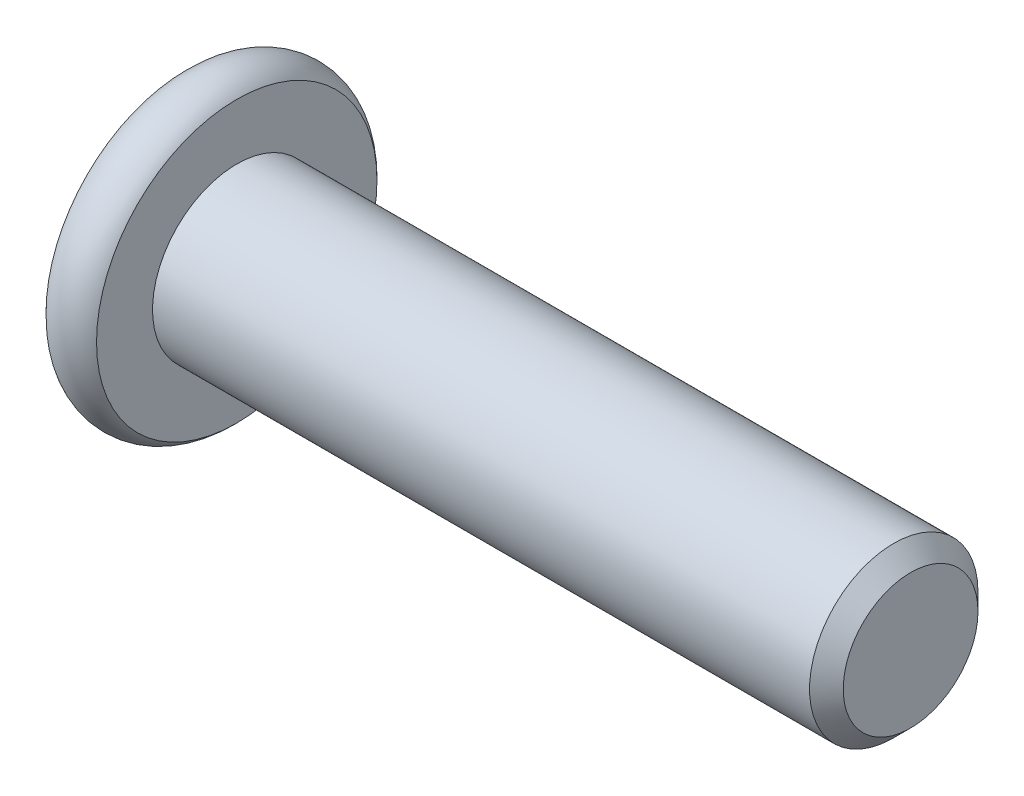
ISO-10303-21;
HEADER;
FILE_DESCRIPTION(('STEP AP214'),'2;1');
FILE_NAME('part.step','',(''),(''),'','','');
FILE_SCHEMA(('AUTOMOTIVE_DESIGN { 1 0 10303 214 1 1 1 1 }'));
ENDSEC;
DATA;
#1=APPLICATION_CONTEXT('core data for automotive mechanical design processes');
#2=APPLICATION_PROTOCOL_DEFINITION('international standard','automotive_design',2000,#1);
#3=PRODUCT_CONTEXT('',#1,'mechanical');
#4=PRODUCT('Part','Part','',(#3));
#5=PRODUCT_RELATED_PRODUCT_CATEGORY('part','',(#4));
#6=PRODUCT_DEFINITION_FORMATION('','',#4);
#7=PRODUCT_DEFINITION_CONTEXT('part definition',#1,'design');
#8=PRODUCT_DEFINITION('design','',#6,#7);
#9=PRODUCT_DEFINITION_SHAPE('','',#8);
#10=(LENGTH_UNIT() NAMED_UNIT(*) SI_UNIT(.MILLI.,.METRE.));
#11=(NAMED_UNIT(*) PLANE_ANGLE_UNIT() SI_UNIT($,.RADIAN.));
#12=(NAMED_UNIT(*) SI_UNIT($,.STERADIAN.) SOLID_ANGLE_UNIT());
#13=UNCERTAINTY_MEASURE_WITH_UNIT(LENGTH_MEASURE(1.E-05),#10,'distance_accuracy_value','');
#14=(GEOMETRIC_REPRESENTATION_CONTEXT(3) GLOBAL_UNCERTAINTY_ASSIGNED_CONTEXT((#13)) GLOBAL_UNIT_ASSIGNED_CONTEXT((#10,
#11,#12)) REPRESENTATION_CONTEXT('',''));
#15=CARTESIAN_POINT('',(0.,0.,0.));
#16=DIRECTION('',(0.,0.,1.));
#17=DIRECTION('',(1.,0.,0.));
#18=AXIS2_PLACEMENT_3D('',#15,#16,#17);
#19=CARTESIAN_POINT('',(-20.,0.,0.));
#20=DIRECTION('',(1.,0.,0.));
#21=DIRECTION('',(0.,0.,-1.));
#22=AXIS2_PLACEMENT_3D('',#19,#20,#21);
#23=CYLINDRICAL_SURFACE('',#22,2.5);
#24=CARTESIAN_POINT('',(-0.5,0.,0.));
#25=DIRECTION('',(1.,0.,0.));
#26=DIRECTION('',(0.,0.,-1.));
#27=AXIS2_PLACEMENT_3D('',#24,#25,#26);
#28=CIRCLE('',#27,2.5);
#29=CARTESIAN_POINT('',(-0.5,0.,-2.5));
#30=VERTEX_POINT('',#29);
#31=EDGE_CURVE('E60',#30,#30,#28,.F.);
#32=ORIENTED_EDGE('',*,*,#31,.T.);
#33=EDGE_LOOP('',(#32));
#34=FACE_BOUND('',#33,.T.);
#35=CARTESIAN_POINT('',(-20.,0.,0.));
#36=DIRECTION('',(-1.,0.,0.));
#37=DIRECTION('',(0.,-1.,0.));
#38=AXIS2_PLACEMENT_3D('',#35,#36,#37);
#39=CIRCLE('',#38,2.5);
#40=CARTESIAN_POINT('',(-20.,-2.50000000000001,0.));
#41=VERTEX_POINT('',#40);
#42=EDGE_CURVE('E136',#41,#41,#39,.F.);
#43=ORIENTED_EDGE('',*,*,#42,.T.);
#44=EDGE_LOOP('',(#43));
#45=FACE_BOUND('',#44,.T.);
#46=ADVANCED_FACE('F47',(#34,#45),#23,.T.);
#47=CARTESIAN_POINT('',(0.,0.,0.));
#48=DIRECTION('',(1.,0.,0.));
#49=DIRECTION('',(0.,0.,-1.));
#50=AXIS2_PLACEMENT_3D('',#47,#48,#49);
#51=PLANE('',#50);
#52=CARTESIAN_POINT('',(0.,0.,0.));
#53=DIRECTION('',(1.,0.,0.));
#54=DIRECTION('',(0.,0.,-1.));
#55=AXIS2_PLACEMENT_3D('',#52,#53,#54);
#56=CIRCLE('',#55,2.);
#57=CARTESIAN_POINT('',(0.,0.,-2.));
#58=VERTEX_POINT('',#57);
#59=EDGE_CURVE('E139',#58,#58,#56,.T.);
#60=ORIENTED_EDGE('',*,*,#59,.T.);
#61=EDGE_LOOP('',(#60));
#62=FACE_BOUND('',#61,.T.);
#63=ADVANCED_FACE('F149',(#62),#51,.T.);
#64=CARTESIAN_POINT('',(0.,0.,0.));
#65=DIRECTION('',(-1.,0.,0.));
#66=DIRECTION('',(0.,0.,1.));
#67=AXIS2_PLACEMENT_3D('',#64,#65,#66);
#68=CONICAL_SURFACE('',#67,2.,0.785398163397446);
#69=ORIENTED_EDGE('',*,*,#31,.F.);
#70=EDGE_LOOP('',(#69));
#71=FACE_BOUND('',#70,.T.);
#72=ORIENTED_EDGE('',*,*,#59,.F.);
#73=EDGE_LOOP('',(#72));
#74=FACE_BOUND('',#73,.T.);
#75=ADVANCED_FACE('F49',(#71,#74),#68,.T.);
#76=CARTESIAN_POINT('',(-21.5,0.,0.));
#77=DIRECTION('',(1.,0.,0.));
#78=DIRECTION('',(0.,1.,0.));
#79=AXIS2_PLACEMENT_3D('',#76,#77,#78);
#80=PLANE('',#79);
#81=CARTESIAN_POINT('',(-21.5,0.,0.));
#82=DIRECTION('',(-1.,0.,0.));
#83=DIRECTION('',(0.,-1.,0.));
#84=AXIS2_PLACEMENT_3D('',#81,#82,#83);
#85=CIRCLE('',#84,1.78205080756886);
#86=CARTESIAN_POINT('',(-21.5,-1.78205080756877,0.));
#87=VERTEX_POINT('',#86);
#88=EDGE_CURVE('E249',#87,#87,#85,.T.);
#89=ORIENTED_EDGE('',*,*,#88,.F.);
#90=EDGE_LOOP('',(#89));
#91=FACE_BOUND('',#90,.T.);
#92=CARTESIAN_POINT('',(-21.5,0.,0.));
#93=DIRECTION('',(-1.,0.,0.));
#94=DIRECTION('',(0.,-1.,0.));
#95=AXIS2_PLACEMENT_3D('',#92,#93,#94);
#96=CIRCLE('',#95,4.16143782776615);
#97=CARTESIAN_POINT('',(-21.5,-4.16143782776614,0.));
#98=VERTEX_POINT('',#97);
#99=EDGE_CURVE('E133',#98,#98,#96,.T.);
#100=ORIENTED_EDGE('',*,*,#99,.T.);
#101=EDGE_LOOP('',(#100));
#102=FACE_BOUND('',#101,.T.);
#103=ADVANCED_FACE('F148',(#91,#102),#80,.F.);
#104=CARTESIAN_POINT('',(-20.75,0.,0.));
#105=DIRECTION('',(-1.,0.,0.));
#106=DIRECTION('',(0.,-1.,0.));
#107=AXIS2_PLACEMENT_3D('',#104,#105,#106);
#108=TOROIDAL_SURFACE('',#107,3.5,1.);
#109=ORIENTED_EDGE('',*,*,#99,.F.);
#110=EDGE_LOOP('',(#109));
#111=FACE_BOUND('',#110,.T.);
#112=CARTESIAN_POINT('',(-20.,0.,0.));
#113=DIRECTION('',(-1.,0.,0.));
#114=DIRECTION('',(0.,-1.,0.));
#115=AXIS2_PLACEMENT_3D('',#112,#113,#114);
#116=CIRCLE('',#115,4.16143782776615);
#117=CARTESIAN_POINT('',(-20.,-4.16143782776615,0.));
#118=VERTEX_POINT('',#117);
#119=EDGE_CURVE('E130',#118,#118,#116,.T.);
#120=ORIENTED_EDGE('',*,*,#119,.T.);
#121=EDGE_LOOP('',(#120));
#122=FACE_BOUND('',#121,.T.);
#123=ADVANCED_FACE('F160',(#111,#122),#108,.T.);
#124=CARTESIAN_POINT('',(-20.,4.16143782776615,0.));
#125=DIRECTION('',(-1.,0.,0.));
#126=DIRECTION('',(0.,-1.,0.));
#127=AXIS2_PLACEMENT_3D('',#124,#125,#126);
#128=PLANE('',#127);
#129=ORIENTED_EDGE('',*,*,#42,.F.);
#130=EDGE_LOOP('',(#129));
#131=FACE_BOUND('',#130,.T.);
#132=ORIENTED_EDGE('',*,*,#119,.F.);
#133=EDGE_LOOP('',(#132));
#134=FACE_BOUND('',#133,.T.);
#135=ADVANCED_FACE('F164',(#131,#134),#128,.F.);
#136=CARTESIAN_POINT('',(-21.5,0.,0.));
#137=DIRECTION('',(-1.,0.,0.));
#138=DIRECTION('',(0.,-1.,0.));
#139=AXIS2_PLACEMENT_3D('',#136,#137,#138);
#140=CONICAL_SURFACE('',#139,1.78205080756886,0.78539816339745);
#141=ORIENTED_EDGE('',*,*,#88,.T.);
#142=EDGE_LOOP('',(#141));
#143=FACE_BOUND('',#142,.T.);
#144=CARTESIAN_POINT('',(-22.015428085613,-1.74023253176573,1.5));
#145=CARTESIAN_POINT('',(-21.9833811073445,-1.69791724929727,1.5));
#146=CARTESIAN_POINT('',(-21.9516444672841,-1.65536760966788,1.5));
#147=CARTESIAN_POINT('',(-21.8889203936153,-1.56970398156681,1.5));
#148=CARTESIAN_POINT('',(-21.85793314822,-1.52658985542845,1.5));
#149=CARTESIAN_POINT('',(-21.765846164345,-1.39562626326559,1.5));
#150=CARTESIAN_POINT('',(-21.7061145123021,-1.30679868010572,1.5));
#151=CARTESIAN_POINT('',(-21.5887342891012,-1.12044622640211,1.5));
#152=CARTESIAN_POINT('',(-21.5314082774823,-1.02271587306669,1.5));
#153=CARTESIAN_POINT('',(-21.426463214976,-0.822357214965219,1.5));
#154=CARTESIAN_POINT('',(-21.3788114236896,-0.719746931701882,1.5));
#155=CARTESIAN_POINT('',(-21.320509988315,-0.565852387095054,1.5));
#156=CARTESIAN_POINT('',(-21.3037990535409,-0.516874191424642,1.5));
#157=CARTESIAN_POINT('',(-21.2743077515089,-0.41772398845748,1.5));
#158=CARTESIAN_POINT('',(-21.2615276514219,-0.367551900263847,1.5));
#159=CARTESIAN_POINT('',(-21.2407784202458,-0.267158299056097,1.5));
#160=CARTESIAN_POINT('',(-21.2327260618259,-0.216954261864833,1.5));
#161=CARTESIAN_POINT('',(-21.221591636834,-0.115994915871297,1.5));
#162=CARTESIAN_POINT('',(-21.2185086886377,-0.0652397064615148,1.5));
#163=CARTESIAN_POINT('',(-21.2175473897404,0.0344222234875812,1.5));
#164=CARTESIAN_POINT('',(-21.2194789216952,0.0833271701101152,1.5));
#165=CARTESIAN_POINT('',(-21.2280175729677,0.180724293127248,1.5));
#166=CARTESIAN_POINT('',(-21.234625142048,0.229216429361756,1.5));
#167=CARTESIAN_POINT('',(-21.2522650626447,0.326258027697034,1.5));
#168=CARTESIAN_POINT('',(-21.263373168201,0.374793507450053,1.5));
#169=CARTESIAN_POINT('',(-21.2894198669595,0.470802295834207,1.5));
#170=CARTESIAN_POINT('',(-21.3043581560035,0.518275688481311,1.5));
#171=CARTESIAN_POINT('',(-21.356839545716,0.667150562065161,1.5));
#172=CARTESIAN_POINT('',(-21.4003351165442,0.766448362426881,1.5));
#173=CARTESIAN_POINT('',(-21.4970587814836,0.960384405673869,1.5));
#174=CARTESIAN_POINT('',(-21.5503217226675,1.05500437383624,1.5));
#175=CARTESIAN_POINT('',(-21.6602258010453,1.23584520321535,1.5));
#176=CARTESIAN_POINT('',(-21.7165682531046,1.32224986946553,1.5));
#177=CARTESIAN_POINT('',(-21.803675572597,1.44954953726477,1.5));
#178=CARTESIAN_POINT('',(-21.8330199906839,1.49143368482427,1.5));
#179=CARTESIAN_POINT('',(-21.8924869182931,1.57462914783248,1.5));
#180=CARTESIAN_POINT('',(-21.9226092115007,1.61594061772583,1.5));
#181=CARTESIAN_POINT('',(-21.9530541181366,1.65701358742556,1.5));
#182=B_SPLINE_CURVE_WITH_KNOTS('',3,(#144,#145,#146,#147,#148,#149,#150,#151,#152,#153,#154,
#155,#156,#157,#158,#159,#160,#161,#162,#163,#164,#165,#166,#167,#168,#169,#170,#171,#172,#173,
#174,#175,#176,#177,#178,#179,#180,#181),.UNSPECIFIED.,.F.,.F.,(4,2,2,2,2,2,2,2,2,2,2,2,2,2,2,2,
2,2,4),(0.,0.159238974218354,0.318517535014543,0.639504781932386,0.979137893799193,
1.31760168934357,1.47272233841624,1.62785352839775,1.78016486537346,1.93244917778279,
2.07904486260297,2.22565464958332,2.37484213303399,2.52401777304039,2.84828365283775,
3.1737297566675,3.48303030530537,3.63644667013909,3.78982082222913),.UNSPECIFIED.);
#183=CARTESIAN_POINT('',(-21.45,-0.866025403784357,1.5));
#184=VERTEX_POINT('',#183);
#185=CARTESIAN_POINT('',(-21.45,0.866025403784521,1.5));
#186=VERTEX_POINT('',#185);
#187=EDGE_CURVE('E114',#184,#186,#182,.T.);
#188=ORIENTED_EDGE('',*,*,#187,.F.);
#189=CARTESIAN_POINT('',(-21.4501154816001,-1.73216627762263,-0.0002000000000008));
#190=CARTESIAN_POINT('',(-21.4203654760674,-1.70239359975907,0.0513677907370744));
#191=CARTESIAN_POINT('',(-21.3923624839103,-1.67212305186347,0.103797917665199));
#192=CARTESIAN_POINT('',(-21.3410892304402,-1.61039789003611,0.210709034055595));
#193=CARTESIAN_POINT('',(-21.3178475050444,-1.57893740312606,0.26520019581466));
#194=CARTESIAN_POINT('',(-21.2780337289922,-1.51549879897979,0.375079081357248));
#195=CARTESIAN_POINT('',(-21.2613615856709,-1.48353684526802,0.430438809095199));
#196=CARTESIAN_POINT('',(-21.2356744568181,-1.41890915196203,0.54237725747715));
#197=CARTESIAN_POINT('',(-21.2266402904789,-1.3862453878111,0.598952556553009));
#198=CARTESIAN_POINT('',(-21.2184890812269,-1.32995210095291,0.696455389516442));
#199=CARTESIAN_POINT('',(-21.2172822529892,-1.30639533311116,0.737256908280467));
#200=CARTESIAN_POINT('',(-21.2193140571623,-1.25932335290185,0.818787969615859));
#201=CARTESIAN_POINT('',(-21.2225536707483,-1.23580815085305,0.859517494314631));
#202=CARTESIAN_POINT('',(-21.233291985982,-1.18900414978418,0.940584402163417));
#203=CARTESIAN_POINT('',(-21.2407946530188,-1.16571558211711,0.980921384598289));
#204=CARTESIAN_POINT('',(-21.2596516119283,-1.11952932016327,1.06091833691403));
#205=CARTESIAN_POINT('',(-21.2710075570186,-1.09663179808778,1.10057800851621));
#206=CARTESIAN_POINT('',(-21.3047216475927,-1.0379815980969,1.20216313477449));
#207=CARTESIAN_POINT('',(-21.3296218490934,-1.00259267147457,1.26345855370969));
#208=CARTESIAN_POINT('',(-21.3716566532716,-0.950557780604292,1.35358562846331));
#209=CARTESIAN_POINT('',(-21.3864251535591,-0.933410759677065,1.38328513990772));
#210=CARTESIAN_POINT('',(-21.4173105659402,-0.899432101996325,1.44213790138375));
#211=CARTESIAN_POINT('',(-21.4334268341217,-0.882600319285629,1.47129140422064));
#212=CARTESIAN_POINT('',(-21.4501154816001,-0.865909933730519,1.5002));
#213=B_SPLINE_CURVE_WITH_KNOTS('',3,(#189,#190,#191,#192,#193,#194,#195,#196,#197,#198,#199,
#200,#201,#202,#203,#204,#205,#206,#207,#208,#209,#210,#211,#212),.UNSPECIFIED.,.F.,.F.,(4,2,2,
2,2,2,2,2,2,2,2,4),(0.,0.199829143693305,0.400822987382389,0.598623720538181,0.795926240188891,
0.937113067959883,1.07833105577193,1.21968061668222,1.36109089931055,1.58570969637566,
1.69770705470964,1.80965120737194),.UNSPECIFIED.);
#214=CARTESIAN_POINT('',(-21.45,-1.73205080756879,0.));
#215=VERTEX_POINT('',#214);
#216=EDGE_CURVE('E206',#215,#184,#213,.T.);
#217=ORIENTED_EDGE('',*,*,#216,.F.);
#218=CARTESIAN_POINT('',(-21.4501154816001,-0.865909933730519,-1.5002));
#219=CARTESIAN_POINT('',(-21.4203654760674,-0.895682611594084,-1.44863220926292));
#220=CARTESIAN_POINT('',(-21.3923624839103,-0.925953159489683,-1.3962020823348));
#221=CARTESIAN_POINT('',(-21.3410892304402,-0.987678321317041,-1.2892909659444));
#222=CARTESIAN_POINT('',(-21.3178475050444,-1.01913880822709,-1.23479980418534));
#223=CARTESIAN_POINT('',(-21.2780337289922,-1.08257741237336,-1.12492091864275));
#224=CARTESIAN_POINT('',(-21.2613615856709,-1.11453936608513,-1.0695611909048));
#225=CARTESIAN_POINT('',(-21.2356744568181,-1.17916705939112,-0.957622742522851));
#226=CARTESIAN_POINT('',(-21.2266402904789,-1.21183082354205,-0.901047443446993));
#227=CARTESIAN_POINT('',(-21.2184890812269,-1.26812411040024,-0.80354461048356));
#228=CARTESIAN_POINT('',(-21.2172822529892,-1.291680878242,-0.762743091719535));
#229=CARTESIAN_POINT('',(-21.2193140571623,-1.3387528584513,-0.681212030384143));
#230=CARTESIAN_POINT('',(-21.2225536707483,-1.3622680605001,-0.640482505685371));
#231=CARTESIAN_POINT('',(-21.233291985982,-1.40907206156897,-0.559415597836585));
#232=CARTESIAN_POINT('',(-21.2407946530188,-1.43236062923604,-0.519078615401714));
#233=CARTESIAN_POINT('',(-21.2596516119283,-1.47854689118988,-0.439081663085971));
#234=CARTESIAN_POINT('',(-21.2710075570186,-1.50144441326537,-0.399421991483794));
#235=CARTESIAN_POINT('',(-21.3047216475927,-1.56009461325625,-0.297836865225517));
#236=CARTESIAN_POINT('',(-21.3296218490934,-1.59548353987858,-0.236541446290313));
#237=CARTESIAN_POINT('',(-21.3716566532716,-1.64751843074886,-0.146414371536688));
#238=CARTESIAN_POINT('',(-21.3864251535591,-1.66466545167609,-0.116714860092285));
#239=CARTESIAN_POINT('',(-21.4173105659402,-1.69864410935683,-0.0578620986162509));
#240=CARTESIAN_POINT('',(-21.4334268341217,-1.71547589206752,-0.0287085957793639));
#241=CARTESIAN_POINT('',(-21.4501154816001,-1.73216627762263,0.00019999999999943));
#242=B_SPLINE_CURVE_WITH_KNOTS('',3,(#218,#219,#220,#221,#222,#223,#224,#225,#226,#227,#228,
#229,#230,#231,#232,#233,#234,#235,#236,#237,#238,#239,#240,#241),.UNSPECIFIED.,.F.,.F.,(4,2,2,
2,2,2,2,2,2,2,2,4),(0.,0.199829143693304,0.400822987382386,0.598623720538178,0.795926240188888,
0.937113067959879,1.07833105577193,1.21968061668222,1.36109089931054,1.58570969637565,
1.69770705470963,1.80965120737194),.UNSPECIFIED.);
#243=CARTESIAN_POINT('',(-21.45,-0.866025403784356,-1.5));
#244=VERTEX_POINT('',#243);
#245=EDGE_CURVE('E201',#244,#215,#242,.T.);
#246=ORIENTED_EDGE('',*,*,#245,.F.);
#247=CARTESIAN_POINT('',(-22.0154280857208,-1.74023253190806,-1.5));
#248=CARTESIAN_POINT('',(-21.9833811074482,-1.69791724943558,-1.5));
#249=CARTESIAN_POINT('',(-21.9516444673836,-1.65536760980217,-1.5));
#250=CARTESIAN_POINT('',(-21.8889203937065,-1.569703981693,-1.5));
#251=CARTESIAN_POINT('',(-21.8579331483071,-1.52658985555058,-1.5));
#252=CARTESIAN_POINT('',(-21.7658461644196,-1.39562626337528,-1.5));
#253=CARTESIAN_POINT('',(-21.7061145123685,-1.30679868020694,-1.5));
#254=CARTESIAN_POINT('',(-21.5887342891506,-1.12044622648488,-1.5));
#255=CARTESIAN_POINT('',(-21.5314082775229,-1.02271587313942,-1.5));
#256=CARTESIAN_POINT('',(-21.4264632150005,-0.822357215017008,-1.5));
#257=CARTESIAN_POINT('',(-21.3788114237068,-0.719746931742781,-1.5));
#258=CARTESIAN_POINT('',(-21.3205099883267,-0.565852387127772,-1.5));
#259=CARTESIAN_POINT('',(-21.3037990535528,-0.516874191460807,-1.5));
#260=CARTESIAN_POINT('',(-21.2743077515206,-0.417723988500656,-1.5));
#261=CARTESIAN_POINT('',(-21.2615276514332,-0.367551900310585,-1.5));
#262=CARTESIAN_POINT('',(-21.2407784202553,-0.267158299109846,-1.5));
#263=CARTESIAN_POINT('',(-21.2327260618343,-0.216954261922027,-1.5));
#264=CARTESIAN_POINT('',(-21.2215916368391,-0.11599491593527,-1.5));
#265=CARTESIAN_POINT('',(-21.2185086886407,-0.0652397065288216,-1.5));
#266=CARTESIAN_POINT('',(-21.2175473897388,0.0344222234142057,-1.5));
#267=CARTESIAN_POINT('',(-21.219478921691,0.0833271700339959,-1.5));
#268=CARTESIAN_POINT('',(-21.228017572958,0.18072429304592,-1.5));
#269=CARTESIAN_POINT('',(-21.2346251420354,0.229216429277964,-1.5));
#270=CARTESIAN_POINT('',(-21.2522650626259,0.326258027608378,-1.5));
#271=CARTESIAN_POINT('',(-21.2633731681789,0.374793507359005,-1.5));
#272=CARTESIAN_POINT('',(-21.2894198669309,0.470802295738608,-1.5));
#273=CARTESIAN_POINT('',(-21.3043581559716,0.518275688383553,-1.5));
#274=CARTESIAN_POINT('',(-21.3568395456685,0.667150561946207,-1.5));
#275=CARTESIAN_POINT('',(-21.4003351164824,0.766448362289951,-1.5));
#276=CARTESIAN_POINT('',(-21.4970587813916,0.960384405502367,-1.5));
#277=CARTESIAN_POINT('',(-21.5503217225595,1.05500437364815,-1.5));
#278=CARTESIAN_POINT('',(-21.6602258009069,1.23584520299745,-1.5));
#279=CARTESIAN_POINT('',(-21.7165682529518,1.32224986923429,-1.5));
#280=CARTESIAN_POINT('',(-21.8036755724226,1.44954953701381,-1.5));
#281=CARTESIAN_POINT('',(-21.8330199905024,1.49143368456684,-1.5));
#282=CARTESIAN_POINT('',(-21.8924869180973,1.57462914756214,-1.5));
#283=CARTESIAN_POINT('',(-21.9226092112979,1.61594061744905,-1.5));
#284=CARTESIAN_POINT('',(-21.9530541179266,1.65701358714236,-1.5));
#285=B_SPLINE_CURVE_WITH_KNOTS('',3,(#247,#248,#249,#250,#251,#252,#253,#254,#255,#256,#257,
#258,#259,#260,#261,#262,#263,#264,#265,#266,#267,#268,#269,#270,#271,#272,#273,#274,#275,#276,
#277,#278,#279,#280,#281,#282,#283,#284),.UNSPECIFIED.,.F.,.F.,(4,2,2,2,2,2,2,2,2,2,2,2,2,2,2,2,
2,2,4),(0.,0.159238974235481,0.318517535048797,0.63950478200154,0.979137893907506,
1.31760168949067,1.47272233855334,1.62785352852489,1.78016486549104,1.93244917789081,
2.0790448627025,2.22565464967435,2.37484213311584,2.52401777311309,2.8482836528441,
3.17372975660706,3.4830303051878,3.63644666999334,3.78982082205521),.UNSPECIFIED.);
#286=CARTESIAN_POINT('',(-21.45,0.866025403784521,-1.5));
#287=VERTEX_POINT('',#286);
#288=EDGE_CURVE('E67',#287,#244,#285,.F.);
#289=ORIENTED_EDGE('',*,*,#288,.F.);
#290=CARTESIAN_POINT('',(-21.4501154816001,1.7321662776228,0.00020000000000003));
#291=CARTESIAN_POINT('',(-21.4203654760673,1.70239359975923,-0.0513677907370759));
#292=CARTESIAN_POINT('',(-21.3923624839103,1.67212305186363,-0.103797917665201));
#293=CARTESIAN_POINT('',(-21.3410892304402,1.61039789003627,-0.210709034055597));
#294=CARTESIAN_POINT('',(-21.3178475050444,1.57893740312622,-0.265200195814661));
#295=CARTESIAN_POINT('',(-21.2780337289922,1.51549879897995,-0.375079081357247));
#296=CARTESIAN_POINT('',(-21.2613615856709,1.48353684526818,-0.430438809095198));
#297=CARTESIAN_POINT('',(-21.2356744568181,1.4189091519622,-0.542377257477149));
#298=CARTESIAN_POINT('',(-21.2266402904789,1.38624538781127,-0.598952556553007));
#299=CARTESIAN_POINT('',(-21.2184890812269,1.32995210095308,-0.696455389516439));
#300=CARTESIAN_POINT('',(-21.2172822529892,1.30639533311132,-0.737256908280464));
#301=CARTESIAN_POINT('',(-21.2193140571623,1.25932335290202,-0.818787969615856));
#302=CARTESIAN_POINT('',(-21.2225536707483,1.23580815085322,-0.859517494314628));
#303=CARTESIAN_POINT('',(-21.233291985982,1.18900414978435,-0.940584402163414));
#304=CARTESIAN_POINT('',(-21.2407946530187,1.16571558211728,-0.980921384598287));
#305=CARTESIAN_POINT('',(-21.2596516119283,1.11952932016343,-1.06091833691403));
#306=CARTESIAN_POINT('',(-21.2710075570186,1.09663179808795,-1.10057800851621));
#307=CARTESIAN_POINT('',(-21.3047216475927,1.03798159809707,-1.20216313477448));
#308=CARTESIAN_POINT('',(-21.3296218490934,1.00259267147474,-1.26345855370969));
#309=CARTESIAN_POINT('',(-21.3716566532716,0.950557780604457,-1.35358562846331));
#310=CARTESIAN_POINT('',(-21.3864251535591,0.93341075967723,-1.38328513990772));
#311=CARTESIAN_POINT('',(-21.4173105659402,0.89943210199649,-1.44213790138375));
#312=CARTESIAN_POINT('',(-21.4334268341217,0.882600319285793,-1.47129140422064));
#313=CARTESIAN_POINT('',(-21.4501154816001,0.865909933730683,-1.5002));
#314=B_SPLINE_CURVE_WITH_KNOTS('',3,(#290,#291,#292,#293,#294,#295,#296,#297,#298,#299,#300,
#301,#302,#303,#304,#305,#306,#307,#308,#309,#310,#311,#312,#313),.UNSPECIFIED.,.F.,.F.,(4,2,2,
2,2,2,2,2,2,2,2,4),(0.,0.199829143693305,0.400822987382387,0.598623720538179,0.795926240188887,
0.937113067959879,1.07833105577193,1.21968061668222,1.36109089931054,1.58570969637565,
1.69770705470963,1.80965120737194),.UNSPECIFIED.);
#315=CARTESIAN_POINT('',(-21.45,1.73205080756896,0.));
#316=VERTEX_POINT('',#315);
#317=EDGE_CURVE('E13',#316,#287,#314,.T.);
#318=ORIENTED_EDGE('',*,*,#317,.F.);
#319=CARTESIAN_POINT('',(-21.4501154816001,0.865909933730683,1.5002));
#320=CARTESIAN_POINT('',(-21.4203654760673,0.895682611594248,1.44863220926292));
#321=CARTESIAN_POINT('',(-21.3923624839103,0.925953159489847,1.3962020823348));
#322=CARTESIAN_POINT('',(-21.3410892304402,0.987678321317206,1.2892909659444));
#323=CARTESIAN_POINT('',(-21.3178475050444,1.01913880822726,1.23479980418534));
#324=CARTESIAN_POINT('',(-21.2780337289922,1.08257741237353,1.12492091864275));
#325=CARTESIAN_POINT('',(-21.2613615856709,1.1145393660853,1.0695611909048));
#326=CARTESIAN_POINT('',(-21.2356744568181,1.17916705939129,0.957622742522847));
#327=CARTESIAN_POINT('',(-21.2266402904789,1.21183082354222,0.901047443446989));
#328=CARTESIAN_POINT('',(-21.2184890812269,1.2681241104004,0.803544610483557));
#329=CARTESIAN_POINT('',(-21.2172822529892,1.29168087824216,0.762743091719531));
#330=CARTESIAN_POINT('',(-21.2193140571623,1.33875285845146,0.681212030384139));
#331=CARTESIAN_POINT('',(-21.2225536707483,1.36226806050027,0.640482505685368));
#332=CARTESIAN_POINT('',(-21.233291985982,1.40907206156913,0.559415597836582));
#333=CARTESIAN_POINT('',(-21.2407946530187,1.4323606292362,0.51907861540171));
#334=CARTESIAN_POINT('',(-21.2596516119283,1.47854689119005,0.439081663085967));
#335=CARTESIAN_POINT('',(-21.2710075570186,1.50144441326554,0.39942199148379));
#336=CARTESIAN_POINT('',(-21.3047216475927,1.56009461325641,0.297836865225514));
#337=CARTESIAN_POINT('',(-21.3296218490934,1.59548353987875,0.23654144629031));
#338=CARTESIAN_POINT('',(-21.3716566532716,1.64751843074902,0.146414371536686));
#339=CARTESIAN_POINT('',(-21.3864251535591,1.66466545167625,0.116714860092283));
#340=CARTESIAN_POINT('',(-21.4173105659402,1.69864410935699,0.05786209861625));
#341=CARTESIAN_POINT('',(-21.4334268341217,1.71547589206769,0.0287085957793637));
#342=CARTESIAN_POINT('',(-21.4501154816001,1.7321662776228,-0.000199999999999372));
#343=B_SPLINE_CURVE_WITH_KNOTS('',3,(#319,#320,#321,#322,#323,#324,#325,#326,#327,#328,#329,
#330,#331,#332,#333,#334,#335,#336,#337,#338,#339,#340,#341,#342),.UNSPECIFIED.,.F.,.F.,(4,2,2,
2,2,2,2,2,2,2,2,4),(0.,0.199829143693306,0.40082298738239,0.598623720538183,0.795926240188891,
0.937113067959883,1.07833105577193,1.21968061668222,1.36109089931055,1.58570969637565,
1.69770705470963,1.80965120737193),.UNSPECIFIED.);
#344=EDGE_CURVE('E105',#186,#316,#343,.T.);
#345=ORIENTED_EDGE('',*,*,#344,.F.);
#346=EDGE_LOOP('',(#188,#217,#246,#289,#318,#345));
#347=FACE_BOUND('',#346,.T.);
#348=ADVANCED_FACE('F104',(#143,#347),#140,.F.);
#349=CARTESIAN_POINT('',(-19.2,0.,0.));
#350=DIRECTION('',(-1.,0.,0.));
#351=DIRECTION('',(0.,-1.,0.));
#352=AXIS2_PLACEMENT_3D('',#349,#350,#351);
#353=PLANE('',#352);
#354=DIRECTION('',(0.,0.5,-0.866025403784438));
#355=VECTOR('',#354,1.);
#356=CARTESIAN_POINT('',(-19.2,0.866025403784512,1.5));
#357=LINE('',#356,#355);
#358=CARTESIAN_POINT('',(-19.2,0.866025403784512,1.5));
#359=VERTEX_POINT('',#358);
#360=CARTESIAN_POINT('',(-19.2,1.73205080756895,0.));
#361=VERTEX_POINT('',#360);
#362=EDGE_CURVE('E113',#359,#361,#357,.T.);
#363=ORIENTED_EDGE('',*,*,#362,.T.);
#364=DIRECTION('',(0.,-0.5,-0.866025403784439));
#365=VECTOR('',#364,1.);
#366=CARTESIAN_POINT('',(-19.2,1.73205080756895,0.));
#367=LINE('',#366,#365);
#368=CARTESIAN_POINT('',(-19.2,0.866025403784512,-1.5));
#369=VERTEX_POINT('',#368);
#370=EDGE_CURVE('E118',#361,#369,#367,.T.);
#371=ORIENTED_EDGE('',*,*,#370,.T.);
#372=DIRECTION('',(0.,-1.,0.));
#373=VECTOR('',#372,1.);
#374=CARTESIAN_POINT('',(-19.2,0.866025403784512,-1.5));
#375=LINE('',#374,#373);
#376=CARTESIAN_POINT('',(-19.2,-0.866025403784365,-1.5));
#377=VERTEX_POINT('',#376);
#378=EDGE_CURVE('E231',#369,#377,#375,.T.);
#379=ORIENTED_EDGE('',*,*,#378,.T.);
#380=DIRECTION('',(0.,-0.5,0.866025403784439));
#381=VECTOR('',#380,1.);
#382=CARTESIAN_POINT('',(-19.2,-0.866025403784365,-1.5));
#383=LINE('',#382,#381);
#384=CARTESIAN_POINT('',(-19.2,-1.7320508075688,0.));
#385=VERTEX_POINT('',#384);
#386=EDGE_CURVE('E235',#377,#385,#383,.T.);
#387=ORIENTED_EDGE('',*,*,#386,.T.);
#388=DIRECTION('',(0.,0.5,0.866025403784439));
#389=VECTOR('',#388,1.);
#390=CARTESIAN_POINT('',(-19.2,-1.7320508075688,0.));
#391=LINE('',#390,#389);
#392=CARTESIAN_POINT('',(-19.2,-0.866025403784366,1.5));
#393=VERTEX_POINT('',#392);
#394=EDGE_CURVE('E126',#385,#393,#391,.T.);
#395=ORIENTED_EDGE('',*,*,#394,.T.);
#396=DIRECTION('',(0.,1.,0.));
#397=VECTOR('',#396,1.);
#398=CARTESIAN_POINT('',(-19.2,-0.866025403784366,1.5));
#399=LINE('',#398,#397);
#400=EDGE_CURVE('E121',#393,#359,#399,.T.);
#401=ORIENTED_EDGE('',*,*,#400,.T.);
#402=EDGE_LOOP('',(#363,#371,#379,#387,#395,#401));
#403=FACE_BOUND('',#402,.T.);
#404=ADVANCED_FACE('F188',(#403),#353,.T.);
#405=CARTESIAN_POINT('',(-19.2,1.73205080756895,0.));
#406=DIRECTION('',(0.,0.866025403784439,-0.5));
#407=DIRECTION('',(0.,0.5,0.866025403784439));
#408=AXIS2_PLACEMENT_3D('',#405,#406,#407);
#409=PLANE('',#408);
#410=DIRECTION('',(-1.,0.,0.));
#411=VECTOR('',#410,1.);
#412=CARTESIAN_POINT('',(-19.2,1.73205080756895,0.));
#413=LINE('',#412,#411);
#414=EDGE_CURVE('E111',#361,#316,#413,.T.);
#415=ORIENTED_EDGE('',*,*,#414,.T.);
#416=ORIENTED_EDGE('',*,*,#317,.T.);
#417=DIRECTION('',(-1.,0.,0.));
#418=VECTOR('',#417,1.);
#419=CARTESIAN_POINT('',(-19.2,0.866025403784512,-1.5));
#420=LINE('',#419,#418);
#421=EDGE_CURVE('E120',#369,#287,#420,.T.);
#422=ORIENTED_EDGE('',*,*,#421,.F.);
#423=ORIENTED_EDGE('',*,*,#370,.F.);
#424=EDGE_LOOP('',(#415,#416,#422,#423));
#425=FACE_BOUND('',#424,.T.);
#426=ADVANCED_FACE('F116',(#425),#409,.F.);
#427=CARTESIAN_POINT('',(-19.2,0.866025403784512,-1.5));
#428=DIRECTION('',(0.,0.,-1.));
#429=DIRECTION('',(0.,1.,0.));
#430=AXIS2_PLACEMENT_3D('',#427,#428,#429);
#431=PLANE('',#430);
#432=ORIENTED_EDGE('',*,*,#421,.T.);
#433=ORIENTED_EDGE('',*,*,#288,.T.);
#434=DIRECTION('',(-1.,0.,0.));
#435=VECTOR('',#434,1.);
#436=CARTESIAN_POINT('',(-19.2,-0.866025403784365,-1.5));
#437=LINE('',#436,#435);
#438=EDGE_CURVE('E123',#377,#244,#437,.T.);
#439=ORIENTED_EDGE('',*,*,#438,.F.);
#440=ORIENTED_EDGE('',*,*,#378,.F.);
#441=EDGE_LOOP('',(#432,#433,#439,#440));
#442=FACE_BOUND('',#441,.T.);
#443=ADVANCED_FACE('F220',(#442),#431,.F.);
#444=CARTESIAN_POINT('',(-19.2,-0.866025403784365,-1.5));
#445=DIRECTION('',(0.,-0.866025403784439,-0.5));
#446=DIRECTION('',(0.,0.5,-0.866025403784439));
#447=AXIS2_PLACEMENT_3D('',#444,#445,#446);
#448=PLANE('',#447);
#449=ORIENTED_EDGE('',*,*,#438,.T.);
#450=ORIENTED_EDGE('',*,*,#245,.T.);
#451=DIRECTION('',(-1.,0.,0.));
#452=VECTOR('',#451,1.);
#453=CARTESIAN_POINT('',(-19.2,-1.7320508075688,0.));
#454=LINE('',#453,#452);
#455=EDGE_CURVE('E245',#385,#215,#454,.T.);
#456=ORIENTED_EDGE('',*,*,#455,.F.);
#457=ORIENTED_EDGE('',*,*,#386,.F.);
#458=EDGE_LOOP('',(#449,#450,#456,#457));
#459=FACE_BOUND('',#458,.T.);
#460=ADVANCED_FACE('F215',(#459),#448,.F.);
#461=CARTESIAN_POINT('',(-19.2,-1.7320508075688,0.));
#462=DIRECTION('',(0.,-0.866025403784439,0.5));
#463=DIRECTION('',(0.,-0.5,-0.866025403784439));
#464=AXIS2_PLACEMENT_3D('',#461,#462,#463);
#465=PLANE('',#464);
#466=ORIENTED_EDGE('',*,*,#455,.T.);
#467=ORIENTED_EDGE('',*,*,#216,.T.);
#468=DIRECTION('',(-1.,0.,0.));
#469=VECTOR('',#468,1.);
#470=CARTESIAN_POINT('',(-19.2,-0.866025403784366,1.5));
#471=LINE('',#470,#469);
#472=EDGE_CURVE('E242',#393,#184,#471,.T.);
#473=ORIENTED_EDGE('',*,*,#472,.F.);
#474=ORIENTED_EDGE('',*,*,#394,.F.);
#475=EDGE_LOOP('',(#466,#467,#473,#474));
#476=FACE_BOUND('',#475,.T.);
#477=ADVANCED_FACE('F212',(#476),#465,.F.);
#478=CARTESIAN_POINT('',(-19.2,-0.866025403784366,1.5));
#479=DIRECTION('',(0.,0.,1.));
#480=DIRECTION('',(1.,0.,0.));
#481=AXIS2_PLACEMENT_3D('',#478,#479,#480);
#482=PLANE('',#481);
#483=ORIENTED_EDGE('',*,*,#472,.T.);
#484=ORIENTED_EDGE('',*,*,#187,.T.);
#485=DIRECTION('',(-1.,0.,0.));
#486=VECTOR('',#485,1.);
#487=CARTESIAN_POINT('',(-19.2,0.866025403784512,1.5));
#488=LINE('',#487,#486);
#489=EDGE_CURVE('E74',#359,#186,#488,.T.);
#490=ORIENTED_EDGE('',*,*,#489,.F.);
#491=ORIENTED_EDGE('',*,*,#400,.F.);
#492=EDGE_LOOP('',(#483,#484,#490,#491));
#493=FACE_BOUND('',#492,.T.);
#494=ADVANCED_FACE('F171',(#493),#482,.F.);
#495=CARTESIAN_POINT('',(-19.2,0.866025403784512,1.5));
#496=DIRECTION('',(0.,0.866025403784439,0.5));
#497=DIRECTION('',(0.,-0.5,0.866025403784439));
#498=AXIS2_PLACEMENT_3D('',#495,#496,#497);
#499=PLANE('',#498);
#500=ORIENTED_EDGE('',*,*,#489,.T.);
#501=ORIENTED_EDGE('',*,*,#344,.T.);
#502=ORIENTED_EDGE('',*,*,#414,.F.);
#503=ORIENTED_EDGE('',*,*,#362,.F.);
#504=EDGE_LOOP('',(#500,#501,#502,#503));
#505=FACE_BOUND('',#504,.T.);
#506=ADVANCED_FACE('F110',(#505),#499,.F.);
#507=CLOSED_SHELL('',(#46,#63,#75,#103,#123,#135,#348,#404,#426,#443,#460,#477,#494,#506));
#508=MANIFOLD_SOLID_BREP('B2',#507);
#509=ADVANCED_BREP_SHAPE_REPRESENTATION('',(#18,#508),#14);
#510=SHAPE_DEFINITION_REPRESENTATION(#9,#509);
ENDSEC;
END-ISO-10303-21;
